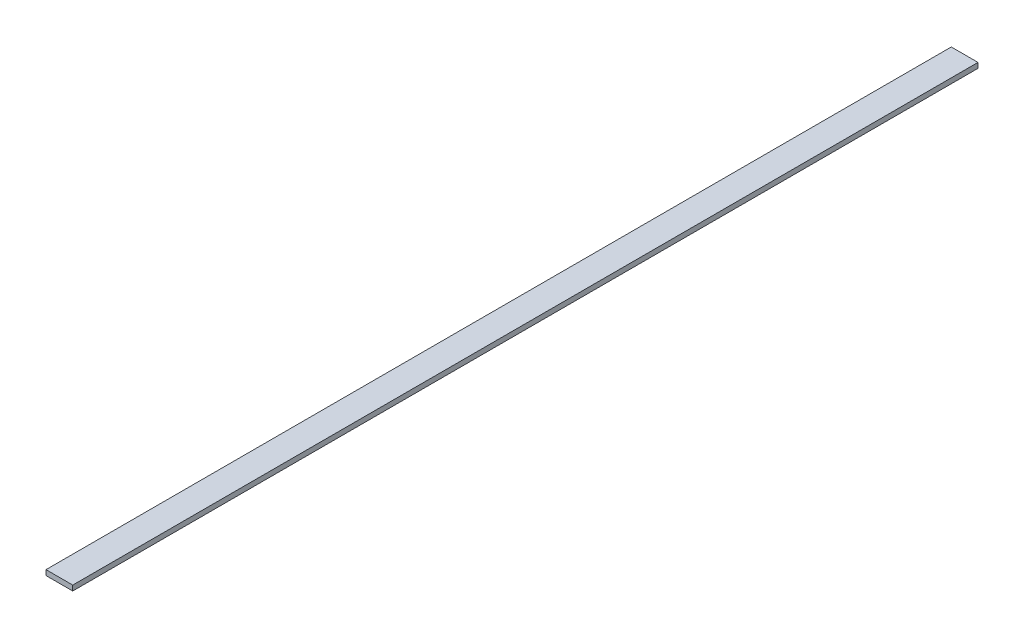
ISO-10303-21;
HEADER;
FILE_DESCRIPTION(('STEP AP214'),'2;1');
FILE_NAME('part.step','',(''),(''),'','','');
FILE_SCHEMA(('AUTOMOTIVE_DESIGN { 1 0 10303 214 1 1 1 1 }'));
ENDSEC;
DATA;
#1=APPLICATION_CONTEXT('core data for automotive mechanical design processes');
#2=APPLICATION_PROTOCOL_DEFINITION('international standard','automotive_design',2000,#1);
#3=PRODUCT_CONTEXT('',#1,'mechanical');
#4=PRODUCT('Part','Part','',(#3));
#5=PRODUCT_RELATED_PRODUCT_CATEGORY('part','',(#4));
#6=PRODUCT_DEFINITION_FORMATION('','',#4);
#7=PRODUCT_DEFINITION_CONTEXT('part definition',#1,'design');
#8=PRODUCT_DEFINITION('design','',#6,#7);
#9=PRODUCT_DEFINITION_SHAPE('','',#8);
#10=(LENGTH_UNIT() NAMED_UNIT(*) SI_UNIT(.MILLI.,.METRE.));
#11=(NAMED_UNIT(*) PLANE_ANGLE_UNIT() SI_UNIT($,.RADIAN.));
#12=(NAMED_UNIT(*) SI_UNIT($,.STERADIAN.) SOLID_ANGLE_UNIT());
#13=UNCERTAINTY_MEASURE_WITH_UNIT(LENGTH_MEASURE(1.E-05),#10,'distance_accuracy_value','');
#14=(GEOMETRIC_REPRESENTATION_CONTEXT(3) GLOBAL_UNCERTAINTY_ASSIGNED_CONTEXT((#13)) GLOBAL_UNIT_ASSIGNED_CONTEXT((#10,
#11,#12)) REPRESENTATION_CONTEXT('',''));
#15=CARTESIAN_POINT('',(0.,0.,0.));
#16=DIRECTION('',(0.,0.,1.));
#17=DIRECTION('',(1.,0.,0.));
#18=AXIS2_PLACEMENT_3D('',#15,#16,#17);
#19=CARTESIAN_POINT('',(0.,0.,-1050.));
#20=DIRECTION('',(-1.,0.,0.));
#21=DIRECTION('',(0.,0.,1.));
#22=AXIS2_PLACEMENT_3D('',#19,#20,#21);
#23=PLANE('',#22);
#24=DIRECTION('',(0.,-1.,0.));
#25=VECTOR('',#24,1.);
#26=CARTESIAN_POINT('',(0.,0.,0.));
#27=LINE('',#26,#25);
#28=CARTESIAN_POINT('',(0.,6.,0.));
#29=VERTEX_POINT('',#28);
#30=CARTESIAN_POINT('',(0.,0.,0.));
#31=VERTEX_POINT('',#30);
#32=EDGE_CURVE('E101',#29,#31,#27,.T.);
#33=ORIENTED_EDGE('',*,*,#32,.F.);
#34=DIRECTION('',(0.,0.,1.));
#35=VECTOR('',#34,1.);
#36=CARTESIAN_POINT('',(0.,6.,-1050.));
#37=LINE('',#36,#35);
#38=CARTESIAN_POINT('',(0.,6.,-1050.));
#39=VERTEX_POINT('',#38);
#40=EDGE_CURVE('E11',#39,#29,#37,.T.);
#41=ORIENTED_EDGE('',*,*,#40,.F.);
#42=DIRECTION('',(0.,-1.,0.));
#43=VECTOR('',#42,1.);
#44=CARTESIAN_POINT('',(0.,0.,-1050.));
#45=LINE('',#44,#43);
#46=CARTESIAN_POINT('',(0.,0.,-1050.));
#47=VERTEX_POINT('',#46);
#48=EDGE_CURVE('E95',#39,#47,#45,.T.);
#49=ORIENTED_EDGE('',*,*,#48,.T.);
#50=DIRECTION('',(0.,0.,1.));
#51=VECTOR('',#50,1.);
#52=CARTESIAN_POINT('',(0.,0.,-1050.));
#53=LINE('',#52,#51);
#54=EDGE_CURVE('E40',#47,#31,#53,.T.);
#55=ORIENTED_EDGE('',*,*,#54,.T.);
#56=EDGE_LOOP('',(#33,#41,#49,#55));
#57=FACE_BOUND('',#56,.T.);
#58=ADVANCED_FACE('F37',(#57),#23,.T.);
#59=CARTESIAN_POINT('',(0.,6.,-1050.));
#60=DIRECTION('',(0.,1.,0.));
#61=DIRECTION('',(0.,0.,1.));
#62=AXIS2_PLACEMENT_3D('',#59,#60,#61);
#63=PLANE('',#62);
#64=DIRECTION('',(-1.,0.,0.));
#65=VECTOR('',#64,1.);
#66=CARTESIAN_POINT('',(0.,6.,0.));
#67=LINE('',#66,#65);
#68=CARTESIAN_POINT('',(31.,6.,0.));
#69=VERTEX_POINT('',#68);
#70=EDGE_CURVE('E97',#69,#29,#67,.T.);
#71=ORIENTED_EDGE('',*,*,#70,.F.);
#72=DIRECTION('',(0.,0.,1.));
#73=VECTOR('',#72,1.);
#74=CARTESIAN_POINT('',(31.,6.,-1050.));
#75=LINE('',#74,#73);
#76=CARTESIAN_POINT('',(31.,6.,-1050.));
#77=VERTEX_POINT('',#76);
#78=EDGE_CURVE('E46',#77,#69,#75,.T.);
#79=ORIENTED_EDGE('',*,*,#78,.F.);
#80=DIRECTION('',(-1.,0.,0.));
#81=VECTOR('',#80,1.);
#82=CARTESIAN_POINT('',(0.,6.,-1050.));
#83=LINE('',#82,#81);
#84=EDGE_CURVE('E92',#77,#39,#83,.T.);
#85=ORIENTED_EDGE('',*,*,#84,.T.);
#86=ORIENTED_EDGE('',*,*,#40,.T.);
#87=EDGE_LOOP('',(#71,#79,#85,#86));
#88=FACE_BOUND('',#87,.T.);
#89=ADVANCED_FACE('F111',(#88),#63,.T.);
#90=CARTESIAN_POINT('',(31.,0.,-1050.));
#91=DIRECTION('',(1.,0.,0.));
#92=DIRECTION('',(0.,0.,-1.));
#93=AXIS2_PLACEMENT_3D('',#90,#91,#92);
#94=PLANE('',#93);
#95=DIRECTION('',(0.,1.,0.));
#96=VECTOR('',#95,1.);
#97=CARTESIAN_POINT('',(31.,0.,0.));
#98=LINE('',#97,#96);
#99=CARTESIAN_POINT('',(31.,0.,0.));
#100=VERTEX_POINT('',#99);
#101=EDGE_CURVE('E87',#100,#69,#98,.T.);
#102=ORIENTED_EDGE('',*,*,#101,.F.);
#103=DIRECTION('',(0.,0.,1.));
#104=VECTOR('',#103,1.);
#105=CARTESIAN_POINT('',(31.,0.,-1050.));
#106=LINE('',#105,#104);
#107=CARTESIAN_POINT('',(31.,0.,-1050.));
#108=VERTEX_POINT('',#107);
#109=EDGE_CURVE('E82',#108,#100,#106,.T.);
#110=ORIENTED_EDGE('',*,*,#109,.F.);
#111=DIRECTION('',(0.,1.,0.));
#112=VECTOR('',#111,1.);
#113=CARTESIAN_POINT('',(31.,0.,-1050.));
#114=LINE('',#113,#112);
#115=EDGE_CURVE('E85',#108,#77,#114,.T.);
#116=ORIENTED_EDGE('',*,*,#115,.T.);
#117=ORIENTED_EDGE('',*,*,#78,.T.);
#118=EDGE_LOOP('',(#102,#110,#116,#117));
#119=FACE_BOUND('',#118,.T.);
#120=ADVANCED_FACE('F84',(#119),#94,.T.);
#121=CARTESIAN_POINT('',(0.,0.,-1050.));
#122=DIRECTION('',(0.,-1.,0.));
#123=DIRECTION('',(0.,0.,-1.));
#124=AXIS2_PLACEMENT_3D('',#121,#122,#123);
#125=PLANE('',#124);
#126=DIRECTION('',(1.,0.,0.));
#127=VECTOR('',#126,1.);
#128=CARTESIAN_POINT('',(0.,0.,0.));
#129=LINE('',#128,#127);
#130=EDGE_CURVE('E104',#31,#100,#129,.T.);
#131=ORIENTED_EDGE('',*,*,#130,.F.);
#132=ORIENTED_EDGE('',*,*,#54,.F.);
#133=DIRECTION('',(1.,0.,0.));
#134=VECTOR('',#133,1.);
#135=CARTESIAN_POINT('',(0.,0.,-1050.));
#136=LINE('',#135,#134);
#137=EDGE_CURVE('E91',#47,#108,#136,.T.);
#138=ORIENTED_EDGE('',*,*,#137,.T.);
#139=ORIENTED_EDGE('',*,*,#109,.T.);
#140=EDGE_LOOP('',(#131,#132,#138,#139));
#141=FACE_BOUND('',#140,.T.);
#142=ADVANCED_FACE('F94',(#141),#125,.T.);
#143=CARTESIAN_POINT('',(0.,0.,-1050.));
#144=DIRECTION('',(0.,0.,-1.));
#145=DIRECTION('',(-1.,0.,0.));
#146=AXIS2_PLACEMENT_3D('',#143,#144,#145);
#147=PLANE('',#146);
#148=ORIENTED_EDGE('',*,*,#48,.F.);
#149=ORIENTED_EDGE('',*,*,#84,.F.);
#150=ORIENTED_EDGE('',*,*,#115,.F.);
#151=ORIENTED_EDGE('',*,*,#137,.F.);
#152=EDGE_LOOP('',(#148,#149,#150,#151));
#153=FACE_BOUND('',#152,.T.);
#154=ADVANCED_FACE('F90',(#153),#147,.T.);
#155=CARTESIAN_POINT('',(0.,0.,0.));
#156=DIRECTION('',(0.,0.,-1.));
#157=DIRECTION('',(-1.,0.,0.));
#158=AXIS2_PLACEMENT_3D('',#155,#156,#157);
#159=PLANE('',#158);
#160=ORIENTED_EDGE('',*,*,#32,.T.);
#161=ORIENTED_EDGE('',*,*,#130,.T.);
#162=ORIENTED_EDGE('',*,*,#101,.T.);
#163=ORIENTED_EDGE('',*,*,#70,.T.);
#164=EDGE_LOOP('',(#160,#161,#162,#163));
#165=FACE_BOUND('',#164,.T.);
#166=ADVANCED_FACE('F110',(#165),#159,.F.);
#167=CLOSED_SHELL('',(#58,#89,#120,#142,#154,#166));
#168=MANIFOLD_SOLID_BREP('B2',#167);
#169=ADVANCED_BREP_SHAPE_REPRESENTATION('',(#18,#168),#14);
#170=SHAPE_DEFINITION_REPRESENTATION(#9,#169);
ENDSEC;
END-ISO-10303-21;
